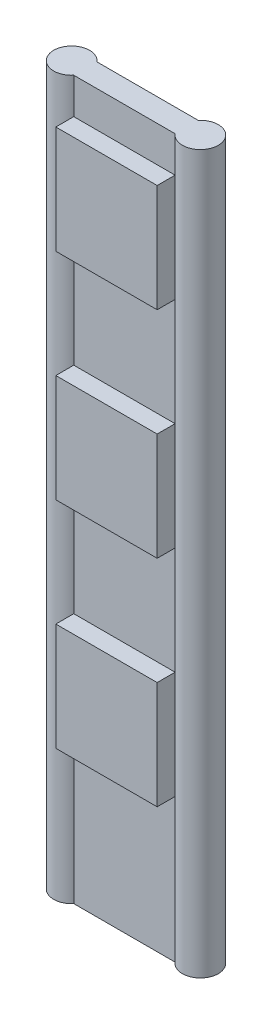
ISO-10303-21;
HEADER;
FILE_DESCRIPTION(('STEP AP214'),'2;1');
FILE_NAME('part.step','',(''),(''),'','','');
FILE_SCHEMA(('AUTOMOTIVE_DESIGN { 1 0 10303 214 1 1 1 1 }'));
ENDSEC;
DATA;
#1=APPLICATION_CONTEXT('core data for automotive mechanical design processes');
#2=APPLICATION_PROTOCOL_DEFINITION('international standard','automotive_design',2000,#1);
#3=PRODUCT_CONTEXT('',#1,'mechanical');
#4=PRODUCT('Part','Part','',(#3));
#5=PRODUCT_RELATED_PRODUCT_CATEGORY('part','',(#4));
#6=PRODUCT_DEFINITION_FORMATION('','',#4);
#7=PRODUCT_DEFINITION_CONTEXT('part definition',#1,'design');
#8=PRODUCT_DEFINITION('design','',#6,#7);
#9=PRODUCT_DEFINITION_SHAPE('','',#8);
#10=(LENGTH_UNIT() NAMED_UNIT(*) SI_UNIT(.MILLI.,.METRE.));
#11=(NAMED_UNIT(*) PLANE_ANGLE_UNIT() SI_UNIT($,.RADIAN.));
#12=(NAMED_UNIT(*) SI_UNIT($,.STERADIAN.) SOLID_ANGLE_UNIT());
#13=UNCERTAINTY_MEASURE_WITH_UNIT(LENGTH_MEASURE(1.E-05),#10,'distance_accuracy_value','');
#14=(GEOMETRIC_REPRESENTATION_CONTEXT(3) GLOBAL_UNCERTAINTY_ASSIGNED_CONTEXT((#13)) GLOBAL_UNIT_ASSIGNED_CONTEXT((#10,
#11,#12)) REPRESENTATION_CONTEXT('',''));
#15=CARTESIAN_POINT('',(0.,0.,0.));
#16=DIRECTION('',(0.,0.,1.));
#17=DIRECTION('',(1.,0.,0.));
#18=AXIS2_PLACEMENT_3D('',#15,#16,#17);
#19=CARTESIAN_POINT('',(0.,2000.,43.1318681318681));
#20=DIRECTION('',(0.,0.,-1.));
#21=DIRECTION('',(-1.,0.,0.));
#22=AXIS2_PLACEMENT_3D('',#19,#20,#21);
#23=PLANE('',#22);
#24=DIRECTION('',(1.,0.,0.));
#25=VECTOR('',#24,1.);
#26=CARTESIAN_POINT('',(-141.24129593448,1600.,43.1318681318681));
#27=LINE('',#26,#25);
#28=CARTESIAN_POINT('',(-141.24129593448,1600.,43.1318681318681));
#29=VERTEX_POINT('',#28);
#30=CARTESIAN_POINT('',(141.24129593448,1600.,43.1318681318681));
#31=VERTEX_POINT('',#30);
#32=EDGE_CURVE('E299',#29,#31,#27,.T.);
#33=ORIENTED_EDGE('',*,*,#32,.F.);
#34=DIRECTION('',(0.,-1.,0.));
#35=VECTOR('',#34,1.);
#36=CARTESIAN_POINT('',(-141.24129593448,2000.,43.1318681318681));
#37=LINE('',#36,#35);
#38=CARTESIAN_POINT('',(-141.24129593448,1300.,43.1318681318681));
#39=VERTEX_POINT('',#38);
#40=EDGE_CURVE('E272',#29,#39,#37,.T.);
#41=ORIENTED_EDGE('',*,*,#40,.T.);
#42=DIRECTION('',(-1.,0.,0.));
#43=VECTOR('',#42,1.);
#44=CARTESIAN_POINT('',(-141.24129593448,1300.,43.1318681318681));
#45=LINE('',#44,#43);
#46=CARTESIAN_POINT('',(141.24129593448,1300.,43.1318681318681));
#47=VERTEX_POINT('',#46);
#48=EDGE_CURVE('E187',#47,#39,#45,.T.);
#49=ORIENTED_EDGE('',*,*,#48,.F.);
#50=DIRECTION('',(0.,-1.,0.));
#51=VECTOR('',#50,1.);
#52=CARTESIAN_POINT('',(141.24129593448,2000.,43.1318681318681));
#53=LINE('',#52,#51);
#54=EDGE_CURVE('E50',#31,#47,#53,.T.);
#55=ORIENTED_EDGE('',*,*,#54,.F.);
#56=EDGE_LOOP('',(#33,#41,#49,#55));
#57=FACE_BOUND('',#56,.T.);
#58=ADVANCED_FACE('F35',(#57),#23,.F.);
#59=DIRECTION('',(-1.,0.,0.));
#60=VECTOR('',#59,1.);
#61=CARTESIAN_POINT('',(-141.24129593448,1900.,43.1318681318681));
#62=LINE('',#61,#60);
#63=CARTESIAN_POINT('',(141.24129593448,1900.,43.1318681318681));
#64=VERTEX_POINT('',#63);
#65=CARTESIAN_POINT('',(-141.24129593448,1900.,43.1318681318681));
#66=VERTEX_POINT('',#65);
#67=EDGE_CURVE('E58',#64,#66,#62,.T.);
#68=ORIENTED_EDGE('',*,*,#67,.F.);
#69=CARTESIAN_POINT('',(141.24129593448,2000.,43.1318681318681));
#70=VERTEX_POINT('',#69);
#71=EDGE_CURVE('E268',#70,#64,#53,.T.);
#72=ORIENTED_EDGE('',*,*,#71,.F.);
#73=DIRECTION('',(1.,0.,0.));
#74=VECTOR('',#73,1.);
#75=CARTESIAN_POINT('',(0.,2000.,43.1318681318681));
#76=LINE('',#75,#74);
#77=CARTESIAN_POINT('',(-141.24129593448,2000.,43.1318681318681));
#78=VERTEX_POINT('',#77);
#79=EDGE_CURVE('E255',#78,#70,#76,.T.);
#80=ORIENTED_EDGE('',*,*,#79,.F.);
#81=EDGE_CURVE('E271',#78,#66,#37,.T.);
#82=ORIENTED_EDGE('',*,*,#81,.T.);
#83=EDGE_LOOP('',(#68,#72,#80,#82));
#84=FACE_BOUND('',#83,.T.);
#85=ADVANCED_FACE('F347',(#84),#23,.F.);
#86=DIRECTION('',(1.,0.,0.));
#87=VECTOR('',#86,1.);
#88=CARTESIAN_POINT('',(-141.24129593448,1000.,43.1318681318681));
#89=LINE('',#88,#87);
#90=CARTESIAN_POINT('',(-141.24129593448,1000.,43.1318681318681));
#91=VERTEX_POINT('',#90);
#92=CARTESIAN_POINT('',(141.24129593448,1000.,43.1318681318681));
#93=VERTEX_POINT('',#92);
#94=EDGE_CURVE('E177',#91,#93,#89,.T.);
#95=ORIENTED_EDGE('',*,*,#94,.F.);
#96=CARTESIAN_POINT('',(-141.24129593448,700.,43.1318681318681));
#97=VERTEX_POINT('',#96);
#98=EDGE_CURVE('E294',#91,#97,#37,.T.);
#99=ORIENTED_EDGE('',*,*,#98,.T.);
#100=DIRECTION('',(-1.,0.,0.));
#101=VECTOR('',#100,1.);
#102=CARTESIAN_POINT('',(-141.24129593448,700.,43.1318681318681));
#103=LINE('',#102,#101);
#104=CARTESIAN_POINT('',(141.24129593448,700.,43.1318681318681));
#105=VERTEX_POINT('',#104);
#106=EDGE_CURVE('E217',#105,#97,#103,.T.);
#107=ORIENTED_EDGE('',*,*,#106,.F.);
#108=EDGE_CURVE('E291',#93,#105,#53,.T.);
#109=ORIENTED_EDGE('',*,*,#108,.F.);
#110=EDGE_LOOP('',(#95,#99,#107,#109));
#111=FACE_BOUND('',#110,.T.);
#112=ADVANCED_FACE('F318',(#111),#23,.F.);
#113=DIRECTION('',(1.,0.,0.));
#114=VECTOR('',#113,1.);
#115=CARTESIAN_POINT('',(-141.24129593448,400.,43.1318681318681));
#116=LINE('',#115,#114);
#117=CARTESIAN_POINT('',(-141.24129593448,400.,43.1318681318681));
#118=VERTEX_POINT('',#117);
#119=CARTESIAN_POINT('',(141.24129593448,400.,43.1318681318681));
#120=VERTEX_POINT('',#119);
#121=EDGE_CURVE('E226',#118,#120,#116,.T.);
#122=ORIENTED_EDGE('',*,*,#121,.F.);
#123=CARTESIAN_POINT('',(-141.24129593448,0.,43.1318681318681));
#124=VERTEX_POINT('',#123);
#125=EDGE_CURVE('E270',#118,#124,#37,.T.);
#126=ORIENTED_EDGE('',*,*,#125,.T.);
#127=DIRECTION('',(1.,0.,0.));
#128=VECTOR('',#127,1.);
#129=CARTESIAN_POINT('',(0.,0.,43.1318681318681));
#130=LINE('',#129,#128);
#131=CARTESIAN_POINT('',(141.24129593448,0.,43.1318681318681));
#132=VERTEX_POINT('',#131);
#133=EDGE_CURVE('E250',#124,#132,#130,.T.);
#134=ORIENTED_EDGE('',*,*,#133,.T.);
#135=EDGE_CURVE('E257',#120,#132,#53,.T.);
#136=ORIENTED_EDGE('',*,*,#135,.F.);
#137=EDGE_LOOP('',(#122,#126,#134,#136));
#138=FACE_BOUND('',#137,.T.);
#139=ADVANCED_FACE('F292',(#138),#23,.F.);
#140=CARTESIAN_POINT('',(179.439423829879,2000.,10.868839363838));
#141=DIRECTION('',(0.,-1.,0.));
#142=DIRECTION('',(0.,0.,-1.));
#143=AXIS2_PLACEMENT_3D('',#140,#141,#142);
#144=CYLINDRICAL_SURFACE('',#143,50.0000000000001);
#145=CARTESIAN_POINT('',(179.439423829879,0.,10.868839363838));
#146=DIRECTION('',(0.,1.,0.));
#147=DIRECTION('',(0.,0.,1.));
#148=AXIS2_PLACEMENT_3D('',#145,#146,#147);
#149=CIRCLE('',#148,50.0000000000001);
#150=CARTESIAN_POINT('',(141.24129593448,0.,-21.394189404192));
#151=VERTEX_POINT('',#150);
#152=EDGE_CURVE('E245',#151,#132,#149,.F.);
#153=ORIENTED_EDGE('',*,*,#152,.F.);
#154=DIRECTION('',(0.,-1.,0.));
#155=VECTOR('',#154,1.);
#156=CARTESIAN_POINT('',(141.24129593448,2000.,-21.394189404192));
#157=LINE('',#156,#155);
#158=CARTESIAN_POINT('',(141.24129593448,2000.,-21.394189404192));
#159=VERTEX_POINT('',#158);
#160=EDGE_CURVE('E11',#159,#151,#157,.T.);
#161=ORIENTED_EDGE('',*,*,#160,.F.);
#162=CARTESIAN_POINT('',(179.439423829879,2000.,10.868839363838));
#163=DIRECTION('',(0.,1.,0.));
#164=DIRECTION('',(0.,0.,1.));
#165=AXIS2_PLACEMENT_3D('',#162,#163,#164);
#166=CIRCLE('',#165,50.0000000000001);
#167=EDGE_CURVE('E246',#159,#70,#166,.F.);
#168=ORIENTED_EDGE('',*,*,#167,.T.);
#169=ORIENTED_EDGE('',*,*,#71,.T.);
#170=DIRECTION('',(0.,1.,0.));
#171=VECTOR('',#170,1.);
#172=CARTESIAN_POINT('',(141.24129593448,1600.,43.1318681318681));
#173=LINE('',#172,#171);
#174=EDGE_CURVE('E526',#31,#64,#173,.T.);
#175=ORIENTED_EDGE('',*,*,#174,.F.);
#176=ORIENTED_EDGE('',*,*,#54,.T.);
#177=DIRECTION('',(0.,1.,0.));
#178=VECTOR('',#177,1.);
#179=CARTESIAN_POINT('',(141.24129593448,1000.,43.1318681318681));
#180=LINE('',#179,#178);
#181=EDGE_CURVE('E196',#93,#47,#180,.T.);
#182=ORIENTED_EDGE('',*,*,#181,.F.);
#183=ORIENTED_EDGE('',*,*,#108,.T.);
#184=DIRECTION('',(0.,1.,0.));
#185=VECTOR('',#184,1.);
#186=CARTESIAN_POINT('',(141.24129593448,400.,43.1318681318681));
#187=LINE('',#186,#185);
#188=EDGE_CURVE('E229',#120,#105,#187,.T.);
#189=ORIENTED_EDGE('',*,*,#188,.F.);
#190=ORIENTED_EDGE('',*,*,#135,.T.);
#191=EDGE_LOOP('',(#153,#161,#168,#169,#175,#176,#182,#183,#189,#190));
#192=FACE_BOUND('',#191,.T.);
#193=ADVANCED_FACE('F37',(#192),#144,.T.);
#194=CARTESIAN_POINT('',(0.,2000.,-21.394189404192));
#195=DIRECTION('',(0.,0.,-1.));
#196=DIRECTION('',(-1.,0.,0.));
#197=AXIS2_PLACEMENT_3D('',#194,#195,#196);
#198=PLANE('',#197);
#199=DIRECTION('',(1.,0.,0.));
#200=VECTOR('',#199,1.);
#201=CARTESIAN_POINT('',(0.,0.,-21.394189404192));
#202=LINE('',#201,#200);
#203=CARTESIAN_POINT('',(-141.24129593448,0.,-21.394189404192));
#204=VERTEX_POINT('',#203);
#205=EDGE_CURVE('E260',#204,#151,#202,.T.);
#206=ORIENTED_EDGE('',*,*,#205,.F.);
#207=DIRECTION('',(0.,-1.,0.));
#208=VECTOR('',#207,1.);
#209=CARTESIAN_POINT('',(-141.24129593448,2000.,-21.394189404192));
#210=LINE('',#209,#208);
#211=CARTESIAN_POINT('',(-141.24129593448,2000.,-21.394189404192));
#212=VERTEX_POINT('',#211);
#213=EDGE_CURVE('E43',#212,#204,#210,.T.);
#214=ORIENTED_EDGE('',*,*,#213,.F.);
#215=DIRECTION('',(1.,0.,0.));
#216=VECTOR('',#215,1.);
#217=CARTESIAN_POINT('',(0.,2000.,-21.394189404192));
#218=LINE('',#217,#216);
#219=EDGE_CURVE('E249',#212,#159,#218,.T.);
#220=ORIENTED_EDGE('',*,*,#219,.T.);
#221=ORIENTED_EDGE('',*,*,#160,.T.);
#222=EDGE_LOOP('',(#206,#214,#220,#221));
#223=FACE_BOUND('',#222,.T.);
#224=ADVANCED_FACE('F285',(#223),#198,.T.);
#225=CARTESIAN_POINT('',(-179.439423829879,2000.,10.8688393638381));
#226=DIRECTION('',(0.,-1.,0.));
#227=DIRECTION('',(0.,0.,-1.));
#228=AXIS2_PLACEMENT_3D('',#225,#226,#227);
#229=CYLINDRICAL_SURFACE('',#228,50.);
#230=CARTESIAN_POINT('',(-179.439423829879,0.,10.8688393638381));
#231=DIRECTION('',(0.,1.,0.));
#232=DIRECTION('',(0.,0.,1.));
#233=AXIS2_PLACEMENT_3D('',#230,#231,#232);
#234=CIRCLE('',#233,50.);
#235=EDGE_CURVE('E263',#204,#124,#234,.T.);
#236=ORIENTED_EDGE('',*,*,#235,.T.);
#237=ORIENTED_EDGE('',*,*,#125,.F.);
#238=DIRECTION('',(0.,-1.,0.));
#239=VECTOR('',#238,1.);
#240=CARTESIAN_POINT('',(-141.24129593448,400.,43.1318681318681));
#241=LINE('',#240,#239);
#242=EDGE_CURVE('E212',#97,#118,#241,.T.);
#243=ORIENTED_EDGE('',*,*,#242,.F.);
#244=ORIENTED_EDGE('',*,*,#98,.F.);
#245=DIRECTION('',(0.,-1.,0.));
#246=VECTOR('',#245,1.);
#247=CARTESIAN_POINT('',(-141.24129593448,1000.,43.1318681318681));
#248=LINE('',#247,#246);
#249=EDGE_CURVE('E174',#39,#91,#248,.T.);
#250=ORIENTED_EDGE('',*,*,#249,.F.);
#251=ORIENTED_EDGE('',*,*,#40,.F.);
#252=DIRECTION('',(0.,-1.,0.));
#253=VECTOR('',#252,1.);
#254=CARTESIAN_POINT('',(-141.24129593448,1600.,43.1318681318681));
#255=LINE('',#254,#253);
#256=EDGE_CURVE('E173',#66,#29,#255,.T.);
#257=ORIENTED_EDGE('',*,*,#256,.F.);
#258=ORIENTED_EDGE('',*,*,#81,.F.);
#259=CARTESIAN_POINT('',(-179.439423829879,2000.,10.8688393638381));
#260=DIRECTION('',(0.,1.,0.));
#261=DIRECTION('',(0.,0.,1.));
#262=AXIS2_PLACEMENT_3D('',#259,#260,#261);
#263=CIRCLE('',#262,50.);
#264=EDGE_CURVE('E253',#212,#78,#263,.T.);
#265=ORIENTED_EDGE('',*,*,#264,.F.);
#266=ORIENTED_EDGE('',*,*,#213,.T.);
#267=EDGE_LOOP('',(#236,#237,#243,#244,#250,#251,#257,#258,#265,#266));
#268=FACE_BOUND('',#267,.T.);
#269=ADVANCED_FACE('F276',(#268),#229,.T.);
#270=CARTESIAN_POINT('',(0.,2000.,0.));
#271=DIRECTION('',(0.,1.,0.));
#272=DIRECTION('',(0.,0.,1.));
#273=AXIS2_PLACEMENT_3D('',#270,#271,#272);
#274=PLANE('',#273);
#275=ORIENTED_EDGE('',*,*,#167,.F.);
#276=ORIENTED_EDGE('',*,*,#219,.F.);
#277=ORIENTED_EDGE('',*,*,#264,.T.);
#278=ORIENTED_EDGE('',*,*,#79,.T.);
#279=EDGE_LOOP('',(#275,#276,#277,#278));
#280=FACE_BOUND('',#279,.T.);
#281=ADVANCED_FACE('F343',(#280),#274,.T.);
#282=CARTESIAN_POINT('',(0.,0.,0.));
#283=DIRECTION('',(0.,1.,0.));
#284=DIRECTION('',(0.,0.,1.));
#285=AXIS2_PLACEMENT_3D('',#282,#283,#284);
#286=PLANE('',#285);
#287=ORIENTED_EDGE('',*,*,#152,.T.);
#288=ORIENTED_EDGE('',*,*,#133,.F.);
#289=ORIENTED_EDGE('',*,*,#235,.F.);
#290=ORIENTED_EDGE('',*,*,#205,.T.);
#291=EDGE_LOOP('',(#287,#288,#289,#290));
#292=FACE_BOUND('',#291,.T.);
#293=ADVANCED_FACE('F284',(#292),#286,.F.);
#294=CARTESIAN_POINT('',(-141.24129593448,400.,93.1318681318681));
#295=DIRECTION('',(1.,0.,0.));
#296=DIRECTION('',(0.,0.,-1.));
#297=AXIS2_PLACEMENT_3D('',#294,#295,#296);
#298=PLANE('',#297);
#299=ORIENTED_EDGE('',*,*,#242,.T.);
#300=DIRECTION('',(0.,0.,-1.));
#301=VECTOR('',#300,1.);
#302=CARTESIAN_POINT('',(-141.24129593448,400.,93.1318681318681));
#303=LINE('',#302,#301);
#304=CARTESIAN_POINT('',(-141.24129593448,400.,93.1318681318681));
#305=VERTEX_POINT('',#304);
#306=EDGE_CURVE('E242',#305,#118,#303,.T.);
#307=ORIENTED_EDGE('',*,*,#306,.F.);
#308=DIRECTION('',(0.,-1.,0.));
#309=VECTOR('',#308,1.);
#310=CARTESIAN_POINT('',(-141.24129593448,400.,93.1318681318681));
#311=LINE('',#310,#309);
#312=CARTESIAN_POINT('',(-141.24129593448,700.,93.1318681318681));
#313=VERTEX_POINT('',#312);
#314=EDGE_CURVE('E213',#313,#305,#311,.T.);
#315=ORIENTED_EDGE('',*,*,#314,.F.);
#316=DIRECTION('',(0.,0.,-1.));
#317=VECTOR('',#316,1.);
#318=CARTESIAN_POINT('',(-141.24129593448,700.,93.1318681318681));
#319=LINE('',#318,#317);
#320=EDGE_CURVE('E223',#313,#97,#319,.T.);
#321=ORIENTED_EDGE('',*,*,#320,.T.);
#322=EDGE_LOOP('',(#299,#307,#315,#321));
#323=FACE_BOUND('',#322,.T.);
#324=ADVANCED_FACE('F335',(#323),#298,.F.);
#325=CARTESIAN_POINT('',(-141.24129593448,400.,93.1318681318681));
#326=DIRECTION('',(0.,1.,0.));
#327=DIRECTION('',(-1.,0.,0.));
#328=AXIS2_PLACEMENT_3D('',#325,#326,#327);
#329=PLANE('',#328);
#330=ORIENTED_EDGE('',*,*,#121,.T.);
#331=DIRECTION('',(0.,0.,-1.));
#332=VECTOR('',#331,1.);
#333=CARTESIAN_POINT('',(141.24129593448,400.,93.1318681318681));
#334=LINE('',#333,#332);
#335=CARTESIAN_POINT('',(141.24129593448,400.,93.1318681318681));
#336=VERTEX_POINT('',#335);
#337=EDGE_CURVE('E239',#336,#120,#334,.T.);
#338=ORIENTED_EDGE('',*,*,#337,.F.);
#339=DIRECTION('',(1.,0.,0.));
#340=VECTOR('',#339,1.);
#341=CARTESIAN_POINT('',(-141.24129593448,400.,93.1318681318681));
#342=LINE('',#341,#340);
#343=EDGE_CURVE('E216',#305,#336,#342,.T.);
#344=ORIENTED_EDGE('',*,*,#343,.F.);
#345=ORIENTED_EDGE('',*,*,#306,.T.);
#346=EDGE_LOOP('',(#330,#338,#344,#345));
#347=FACE_BOUND('',#346,.T.);
#348=ADVANCED_FACE('F333',(#347),#329,.F.);
#349=CARTESIAN_POINT('',(141.24129593448,400.,93.1318681318681));
#350=DIRECTION('',(-1.,0.,0.));
#351=DIRECTION('',(0.,0.,1.));
#352=AXIS2_PLACEMENT_3D('',#349,#350,#351);
#353=PLANE('',#352);
#354=ORIENTED_EDGE('',*,*,#188,.T.);
#355=DIRECTION('',(0.,0.,-1.));
#356=VECTOR('',#355,1.);
#357=CARTESIAN_POINT('',(141.24129593448,700.,93.1318681318681));
#358=LINE('',#357,#356);
#359=CARTESIAN_POINT('',(141.24129593448,700.,93.1318681318681));
#360=VERTEX_POINT('',#359);
#361=EDGE_CURVE('E236',#360,#105,#358,.T.);
#362=ORIENTED_EDGE('',*,*,#361,.F.);
#363=DIRECTION('',(0.,1.,0.));
#364=VECTOR('',#363,1.);
#365=CARTESIAN_POINT('',(141.24129593448,400.,93.1318681318681));
#366=LINE('',#365,#364);
#367=EDGE_CURVE('E219',#336,#360,#366,.T.);
#368=ORIENTED_EDGE('',*,*,#367,.F.);
#369=ORIENTED_EDGE('',*,*,#337,.T.);
#370=EDGE_LOOP('',(#354,#362,#368,#369));
#371=FACE_BOUND('',#370,.T.);
#372=ADVANCED_FACE('F323',(#371),#353,.F.);
#373=CARTESIAN_POINT('',(-141.24129593448,700.,93.1318681318681));
#374=DIRECTION('',(0.,-1.,0.));
#375=DIRECTION('',(0.,0.,-1.));
#376=AXIS2_PLACEMENT_3D('',#373,#374,#375);
#377=PLANE('',#376);
#378=ORIENTED_EDGE('',*,*,#106,.T.);
#379=ORIENTED_EDGE('',*,*,#320,.F.);
#380=DIRECTION('',(-1.,0.,0.));
#381=VECTOR('',#380,1.);
#382=CARTESIAN_POINT('',(-141.24129593448,700.,93.1318681318681));
#383=LINE('',#382,#381);
#384=EDGE_CURVE('E221',#360,#313,#383,.T.);
#385=ORIENTED_EDGE('',*,*,#384,.F.);
#386=ORIENTED_EDGE('',*,*,#361,.T.);
#387=EDGE_LOOP('',(#378,#379,#385,#386));
#388=FACE_BOUND('',#387,.T.);
#389=ADVANCED_FACE('F327',(#388),#377,.F.);
#390=CARTESIAN_POINT('',(0.,0.,93.1318681318681));
#391=DIRECTION('',(0.,0.,-1.));
#392=DIRECTION('',(-1.,0.,0.));
#393=AXIS2_PLACEMENT_3D('',#390,#391,#392);
#394=PLANE('',#393);
#395=ORIENTED_EDGE('',*,*,#314,.T.);
#396=ORIENTED_EDGE('',*,*,#343,.T.);
#397=ORIENTED_EDGE('',*,*,#367,.T.);
#398=ORIENTED_EDGE('',*,*,#384,.T.);
#399=EDGE_LOOP('',(#395,#396,#397,#398));
#400=FACE_BOUND('',#399,.T.);
#401=ADVANCED_FACE('F330',(#400),#394,.F.);
#402=CARTESIAN_POINT('',(-141.24129593448,1000.,93.1318681318681));
#403=DIRECTION('',(1.,0.,0.));
#404=DIRECTION('',(0.,0.,-1.));
#405=AXIS2_PLACEMENT_3D('',#402,#403,#404);
#406=PLANE('',#405);
#407=ORIENTED_EDGE('',*,*,#249,.T.);
#408=DIRECTION('',(0.,0.,-1.));
#409=VECTOR('',#408,1.);
#410=CARTESIAN_POINT('',(-141.24129593448,1000.,93.1318681318681));
#411=LINE('',#410,#409);
#412=CARTESIAN_POINT('',(-141.24129593448,1000.,93.1318681318681));
#413=VERTEX_POINT('',#412);
#414=EDGE_CURVE('E209',#413,#91,#411,.T.);
#415=ORIENTED_EDGE('',*,*,#414,.F.);
#416=DIRECTION('',(0.,-1.,0.));
#417=VECTOR('',#416,1.);
#418=CARTESIAN_POINT('',(-141.24129593448,1000.,93.1318681318681));
#419=LINE('',#418,#417);
#420=CARTESIAN_POINT('',(-141.24129593448,1300.,93.1318681318681));
#421=VERTEX_POINT('',#420);
#422=EDGE_CURVE('E183',#421,#413,#419,.T.);
#423=ORIENTED_EDGE('',*,*,#422,.F.);
#424=DIRECTION('',(0.,0.,-1.));
#425=VECTOR('',#424,1.);
#426=CARTESIAN_POINT('',(-141.24129593448,1300.,93.1318681318681));
#427=LINE('',#426,#425);
#428=EDGE_CURVE('E192',#421,#39,#427,.T.);
#429=ORIENTED_EDGE('',*,*,#428,.T.);
#430=EDGE_LOOP('',(#407,#415,#423,#429));
#431=FACE_BOUND('',#430,.T.);
#432=ADVANCED_FACE('F308',(#431),#406,.F.);
#433=CARTESIAN_POINT('',(-141.24129593448,1000.,93.1318681318681));
#434=DIRECTION('',(0.,1.,0.));
#435=DIRECTION('',(-1.,0.,0.));
#436=AXIS2_PLACEMENT_3D('',#433,#434,#435);
#437=PLANE('',#436);
#438=ORIENTED_EDGE('',*,*,#94,.T.);
#439=DIRECTION('',(0.,0.,-1.));
#440=VECTOR('',#439,1.);
#441=CARTESIAN_POINT('',(141.24129593448,1000.,93.1318681318681));
#442=LINE('',#441,#440);
#443=CARTESIAN_POINT('',(141.24129593448,1000.,93.1318681318681));
#444=VERTEX_POINT('',#443);
#445=EDGE_CURVE('E206',#444,#93,#442,.T.);
#446=ORIENTED_EDGE('',*,*,#445,.F.);
#447=DIRECTION('',(1.,0.,0.));
#448=VECTOR('',#447,1.);
#449=CARTESIAN_POINT('',(-141.24129593448,1000.,93.1318681318681));
#450=LINE('',#449,#448);
#451=EDGE_CURVE('E186',#413,#444,#450,.T.);
#452=ORIENTED_EDGE('',*,*,#451,.F.);
#453=ORIENTED_EDGE('',*,*,#414,.T.);
#454=EDGE_LOOP('',(#438,#446,#452,#453));
#455=FACE_BOUND('',#454,.T.);
#456=ADVANCED_FACE('F317',(#455),#437,.F.);
#457=CARTESIAN_POINT('',(141.24129593448,1000.,93.1318681318681));
#458=DIRECTION('',(-1.,0.,0.));
#459=DIRECTION('',(0.,0.,1.));
#460=AXIS2_PLACEMENT_3D('',#457,#458,#459);
#461=PLANE('',#460);
#462=ORIENTED_EDGE('',*,*,#181,.T.);
#463=DIRECTION('',(0.,0.,-1.));
#464=VECTOR('',#463,1.);
#465=CARTESIAN_POINT('',(141.24129593448,1300.,93.1318681318681));
#466=LINE('',#465,#464);
#467=CARTESIAN_POINT('',(141.24129593448,1300.,93.1318681318681));
#468=VERTEX_POINT('',#467);
#469=EDGE_CURVE('E203',#468,#47,#466,.T.);
#470=ORIENTED_EDGE('',*,*,#469,.F.);
#471=DIRECTION('',(0.,1.,0.));
#472=VECTOR('',#471,1.);
#473=CARTESIAN_POINT('',(141.24129593448,1000.,93.1318681318681));
#474=LINE('',#473,#472);
#475=EDGE_CURVE('E189',#444,#468,#474,.T.);
#476=ORIENTED_EDGE('',*,*,#475,.F.);
#477=ORIENTED_EDGE('',*,*,#445,.T.);
#478=EDGE_LOOP('',(#462,#470,#476,#477));
#479=FACE_BOUND('',#478,.T.);
#480=ADVANCED_FACE('F314',(#479),#461,.F.);
#481=CARTESIAN_POINT('',(-141.24129593448,1300.,93.1318681318681));
#482=DIRECTION('',(0.,-1.,0.));
#483=DIRECTION('',(0.,0.,-1.));
#484=AXIS2_PLACEMENT_3D('',#481,#482,#483);
#485=PLANE('',#484);
#486=ORIENTED_EDGE('',*,*,#48,.T.);
#487=ORIENTED_EDGE('',*,*,#428,.F.);
#488=DIRECTION('',(-1.,0.,0.));
#489=VECTOR('',#488,1.);
#490=CARTESIAN_POINT('',(-141.24129593448,1300.,93.1318681318681));
#491=LINE('',#490,#489);
#492=EDGE_CURVE('E191',#468,#421,#491,.T.);
#493=ORIENTED_EDGE('',*,*,#492,.F.);
#494=ORIENTED_EDGE('',*,*,#469,.T.);
#495=EDGE_LOOP('',(#486,#487,#493,#494));
#496=FACE_BOUND('',#495,.T.);
#497=ADVANCED_FACE('F304',(#496),#485,.F.);
#498=CARTESIAN_POINT('',(0.,0.,93.1318681318681));
#499=DIRECTION('',(0.,0.,-1.));
#500=DIRECTION('',(-1.,0.,0.));
#501=AXIS2_PLACEMENT_3D('',#498,#499,#500);
#502=PLANE('',#501);
#503=ORIENTED_EDGE('',*,*,#422,.T.);
#504=ORIENTED_EDGE('',*,*,#451,.T.);
#505=ORIENTED_EDGE('',*,*,#475,.T.);
#506=ORIENTED_EDGE('',*,*,#492,.T.);
#507=EDGE_LOOP('',(#503,#504,#505,#506));
#508=FACE_BOUND('',#507,.T.);
#509=ADVANCED_FACE('F310',(#508),#502,.F.);
#510=CARTESIAN_POINT('',(-141.24129593448,1600.,93.1318681318681));
#511=DIRECTION('',(1.,0.,0.));
#512=DIRECTION('',(0.,0.,-1.));
#513=AXIS2_PLACEMENT_3D('',#510,#511,#512);
#514=PLANE('',#513);
#515=ORIENTED_EDGE('',*,*,#256,.T.);
#516=DIRECTION('',(0.,0.,-1.));
#517=VECTOR('',#516,1.);
#518=CARTESIAN_POINT('',(-141.24129593448,1600.,93.1318681318681));
#519=LINE('',#518,#517);
#520=CARTESIAN_POINT('',(-141.24129593448,1600.,93.1318681318681));
#521=VERTEX_POINT('',#520);
#522=EDGE_CURVE('E155',#521,#29,#519,.T.);
#523=ORIENTED_EDGE('',*,*,#522,.F.);
#524=DIRECTION('',(0.,-1.,0.));
#525=VECTOR('',#524,1.);
#526=CARTESIAN_POINT('',(-141.24129593448,1600.,93.1318681318681));
#527=LINE('',#526,#525);
#528=CARTESIAN_POINT('',(-141.24129593448,1900.,93.1318681318681));
#529=VERTEX_POINT('',#528);
#530=EDGE_CURVE('E162',#529,#521,#527,.T.);
#531=ORIENTED_EDGE('',*,*,#530,.F.);
#532=DIRECTION('',(0.,0.,-1.));
#533=VECTOR('',#532,1.);
#534=CARTESIAN_POINT('',(-141.24129593448,1900.,93.1318681318681));
#535=LINE('',#534,#533);
#536=EDGE_CURVE('E524',#529,#66,#535,.T.);
#537=ORIENTED_EDGE('',*,*,#536,.T.);
#538=EDGE_LOOP('',(#515,#523,#531,#537));
#539=FACE_BOUND('',#538,.T.);
#540=ADVANCED_FACE('F172',(#539),#514,.F.);
#541=CARTESIAN_POINT('',(-141.24129593448,1600.,93.1318681318681));
#542=DIRECTION('',(0.,1.,0.));
#543=DIRECTION('',(-1.,0.,0.));
#544=AXIS2_PLACEMENT_3D('',#541,#542,#543);
#545=PLANE('',#544);
#546=ORIENTED_EDGE('',*,*,#32,.T.);
#547=DIRECTION('',(0.,0.,-1.));
#548=VECTOR('',#547,1.);
#549=CARTESIAN_POINT('',(141.24129593448,1600.,93.1318681318681));
#550=LINE('',#549,#548);
#551=CARTESIAN_POINT('',(141.24129593448,1600.,93.1318681318681));
#552=VERTEX_POINT('',#551);
#553=EDGE_CURVE('E158',#552,#31,#550,.T.);
#554=ORIENTED_EDGE('',*,*,#553,.F.);
#555=DIRECTION('',(1.,0.,0.));
#556=VECTOR('',#555,1.);
#557=CARTESIAN_POINT('',(-141.24129593448,1600.,93.1318681318681));
#558=LINE('',#557,#556);
#559=EDGE_CURVE('E150',#521,#552,#558,.T.);
#560=ORIENTED_EDGE('',*,*,#559,.F.);
#561=ORIENTED_EDGE('',*,*,#522,.T.);
#562=EDGE_LOOP('',(#546,#554,#560,#561));
#563=FACE_BOUND('',#562,.T.);
#564=ADVANCED_FACE('F153',(#563),#545,.F.);
#565=CARTESIAN_POINT('',(141.24129593448,1600.,93.1318681318681));
#566=DIRECTION('',(-1.,0.,0.));
#567=DIRECTION('',(0.,0.,1.));
#568=AXIS2_PLACEMENT_3D('',#565,#566,#567);
#569=PLANE('',#568);
#570=ORIENTED_EDGE('',*,*,#174,.T.);
#571=DIRECTION('',(0.,0.,-1.));
#572=VECTOR('',#571,1.);
#573=CARTESIAN_POINT('',(141.24129593448,1900.,93.1318681318681));
#574=LINE('',#573,#572);
#575=CARTESIAN_POINT('',(141.24129593448,1900.,93.1318681318681));
#576=VERTEX_POINT('',#575);
#577=EDGE_CURVE('E179',#576,#64,#574,.T.);
#578=ORIENTED_EDGE('',*,*,#577,.F.);
#579=DIRECTION('',(0.,1.,0.));
#580=VECTOR('',#579,1.);
#581=CARTESIAN_POINT('',(141.24129593448,1600.,93.1318681318681));
#582=LINE('',#581,#580);
#583=EDGE_CURVE('E161',#552,#576,#582,.T.);
#584=ORIENTED_EDGE('',*,*,#583,.F.);
#585=ORIENTED_EDGE('',*,*,#553,.T.);
#586=EDGE_LOOP('',(#570,#578,#584,#585));
#587=FACE_BOUND('',#586,.T.);
#588=ADVANCED_FACE('F492',(#587),#569,.F.);
#589=CARTESIAN_POINT('',(-141.24129593448,1900.,93.1318681318681));
#590=DIRECTION('',(0.,-1.,0.));
#591=DIRECTION('',(0.,0.,-1.));
#592=AXIS2_PLACEMENT_3D('',#589,#590,#591);
#593=PLANE('',#592);
#594=ORIENTED_EDGE('',*,*,#67,.T.);
#595=ORIENTED_EDGE('',*,*,#536,.F.);
#596=DIRECTION('',(-1.,0.,0.));
#597=VECTOR('',#596,1.);
#598=CARTESIAN_POINT('',(-141.24129593448,1900.,93.1318681318681));
#599=LINE('',#598,#597);
#600=EDGE_CURVE('E167',#576,#529,#599,.T.);
#601=ORIENTED_EDGE('',*,*,#600,.F.);
#602=ORIENTED_EDGE('',*,*,#577,.T.);
#603=EDGE_LOOP('',(#594,#595,#601,#602));
#604=FACE_BOUND('',#603,.T.);
#605=ADVANCED_FACE('F501',(#604),#593,.F.);
#606=CARTESIAN_POINT('',(0.,0.,93.1318681318681));
#607=DIRECTION('',(0.,0.,-1.));
#608=DIRECTION('',(-1.,0.,0.));
#609=AXIS2_PLACEMENT_3D('',#606,#607,#608);
#610=PLANE('',#609);
#611=ORIENTED_EDGE('',*,*,#530,.T.);
#612=ORIENTED_EDGE('',*,*,#559,.T.);
#613=ORIENTED_EDGE('',*,*,#583,.T.);
#614=ORIENTED_EDGE('',*,*,#600,.T.);
#615=EDGE_LOOP('',(#611,#612,#613,#614));
#616=FACE_BOUND('',#615,.T.);
#617=ADVANCED_FACE('F165',(#616),#610,.F.);
#618=CLOSED_SHELL('',(#58,#85,#112,#139,#193,#224,#269,#281,#293,#324,#348,#372,#389,#401,#432,
#456,#480,#497,#509,#540,#564,#588,#605,#617));
#619=MANIFOLD_SOLID_BREP('B2',#618);
#620=ADVANCED_BREP_SHAPE_REPRESENTATION('',(#18,#619),#14);
#621=SHAPE_DEFINITION_REPRESENTATION(#9,#620);
ENDSEC;
END-ISO-10303-21;
